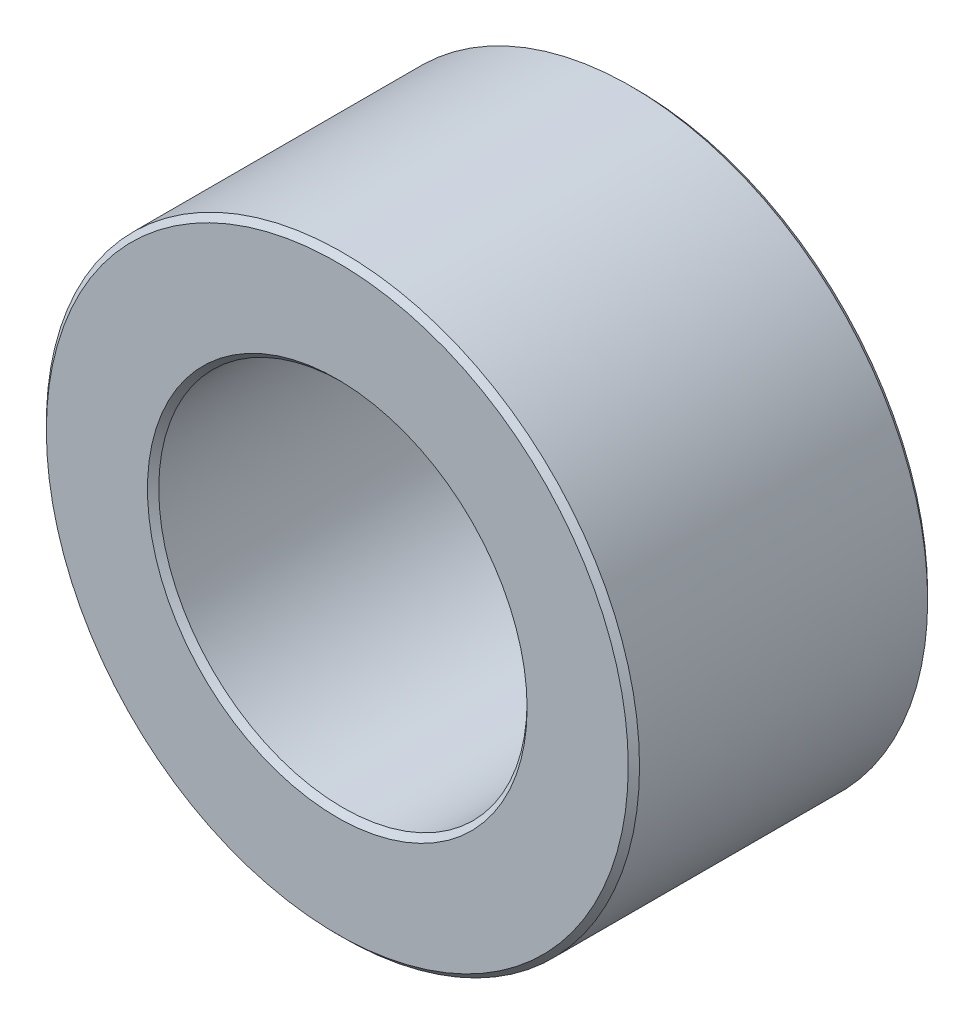
ISO-10303-21;
HEADER;
FILE_DESCRIPTION(('STEP AP214'),'2;1');
FILE_NAME('part.step','',(''),(''),'','','');
FILE_SCHEMA(('AUTOMOTIVE_DESIGN { 1 0 10303 214 1 1 1 1 }'));
ENDSEC;
DATA;
#1=APPLICATION_CONTEXT('core data for automotive mechanical design processes');
#2=APPLICATION_PROTOCOL_DEFINITION('international standard','automotive_design',2000,#1);
#3=PRODUCT_CONTEXT('',#1,'mechanical');
#4=PRODUCT('Part','Part','',(#3));
#5=PRODUCT_RELATED_PRODUCT_CATEGORY('part','',(#4));
#6=PRODUCT_DEFINITION_FORMATION('','',#4);
#7=PRODUCT_DEFINITION_CONTEXT('part definition',#1,'design');
#8=PRODUCT_DEFINITION('design','',#6,#7);
#9=PRODUCT_DEFINITION_SHAPE('','',#8);
#10=(LENGTH_UNIT() NAMED_UNIT(*) SI_UNIT(.MILLI.,.METRE.));
#11=(NAMED_UNIT(*) PLANE_ANGLE_UNIT() SI_UNIT($,.RADIAN.));
#12=(NAMED_UNIT(*) SI_UNIT($,.STERADIAN.) SOLID_ANGLE_UNIT());
#13=UNCERTAINTY_MEASURE_WITH_UNIT(LENGTH_MEASURE(1.E-05),#10,'distance_accuracy_value','');
#14=(GEOMETRIC_REPRESENTATION_CONTEXT(3) GLOBAL_UNCERTAINTY_ASSIGNED_CONTEXT((#13)) GLOBAL_UNIT_ASSIGNED_CONTEXT((#10,
#11,#12)) REPRESENTATION_CONTEXT('',''));
#15=CARTESIAN_POINT('',(0.,0.,0.));
#16=DIRECTION('',(0.,0.,1.));
#17=DIRECTION('',(1.,0.,0.));
#18=AXIS2_PLACEMENT_3D('',#15,#16,#17);
#19=CARTESIAN_POINT('',(0.,0.,53.));
#20=DIRECTION('',(0.,0.,1.));
#21=DIRECTION('',(1.,0.,0.));
#22=AXIS2_PLACEMENT_3D('',#19,#20,#21);
#23=PLANE('',#22);
#24=CARTESIAN_POINT('',(0.,0.,53.));
#25=DIRECTION('',(0.,0.,1.));
#26=DIRECTION('',(1.,0.,0.));
#27=AXIS2_PLACEMENT_3D('',#24,#25,#26);
#28=CIRCLE('',#27,33.6);
#29=CARTESIAN_POINT('',(33.6,0.,53.));
#30=VERTEX_POINT('',#29);
#31=EDGE_CURVE('E48',#30,#30,#28,.F.);
#32=ORIENTED_EDGE('',*,*,#31,.T.);
#33=EDGE_LOOP('',(#32));
#34=FACE_BOUND('',#33,.T.);
#35=CARTESIAN_POINT('',(0.,0.,53.));
#36=DIRECTION('',(0.,0.,1.));
#37=DIRECTION('',(1.,0.,0.));
#38=AXIS2_PLACEMENT_3D('',#35,#36,#37);
#39=CIRCLE('',#38,51.5);
#40=CARTESIAN_POINT('',(51.5,0.,53.));
#41=VERTEX_POINT('',#40);
#42=EDGE_CURVE('E52',#41,#41,#39,.T.);
#43=ORIENTED_EDGE('',*,*,#42,.T.);
#44=EDGE_LOOP('',(#43));
#45=FACE_BOUND('',#44,.T.);
#46=ADVANCED_FACE('F36',(#34,#45),#23,.T.);
#47=CARTESIAN_POINT('',(0.,0.,0.));
#48=DIRECTION('',(0.,0.,1.));
#49=DIRECTION('',(1.,0.,0.));
#50=AXIS2_PLACEMENT_3D('',#47,#48,#49);
#51=PLANE('',#50);
#52=CARTESIAN_POINT('',(0.,0.,0.));
#53=DIRECTION('',(0.,0.,1.));
#54=DIRECTION('',(1.,0.,0.));
#55=AXIS2_PLACEMENT_3D('',#52,#53,#54);
#56=CIRCLE('',#55,33.6);
#57=CARTESIAN_POINT('',(33.6,0.,0.));
#58=VERTEX_POINT('',#57);
#59=EDGE_CURVE('E63',#58,#58,#56,.T.);
#60=ORIENTED_EDGE('',*,*,#59,.T.);
#61=EDGE_LOOP('',(#60));
#62=FACE_BOUND('',#61,.T.);
#63=CARTESIAN_POINT('',(0.,0.,0.));
#64=DIRECTION('',(0.,0.,1.));
#65=DIRECTION('',(1.,0.,0.));
#66=AXIS2_PLACEMENT_3D('',#63,#64,#65);
#67=CIRCLE('',#66,51.5);
#68=CARTESIAN_POINT('',(51.5,0.,0.));
#69=VERTEX_POINT('',#68);
#70=EDGE_CURVE('E66',#69,#69,#67,.F.);
#71=ORIENTED_EDGE('',*,*,#70,.T.);
#72=EDGE_LOOP('',(#71));
#73=FACE_BOUND('',#72,.T.);
#74=ADVANCED_FACE('F70',(#62,#73),#51,.F.);
#75=CARTESIAN_POINT('',(0.,0.,53.));
#76=DIRECTION('',(0.,0.,-1.));
#77=DIRECTION('',(-1.,0.,0.));
#78=AXIS2_PLACEMENT_3D('',#75,#76,#77);
#79=CYLINDRICAL_SURFACE('',#78,52.5);
#80=CARTESIAN_POINT('',(0.,0.,0.999999999999966));
#81=DIRECTION('',(0.,0.,1.));
#82=DIRECTION('',(1.,0.,0.));
#83=AXIS2_PLACEMENT_3D('',#80,#81,#82);
#84=CIRCLE('',#83,52.5);
#85=CARTESIAN_POINT('',(52.5,0.,0.999999999999966));
#86=VERTEX_POINT('',#85);
#87=EDGE_CURVE('E10',#86,#86,#84,.T.);
#88=ORIENTED_EDGE('',*,*,#87,.T.);
#89=EDGE_LOOP('',(#88));
#90=FACE_BOUND('',#89,.T.);
#91=CARTESIAN_POINT('',(0.,0.,52.));
#92=DIRECTION('',(0.,0.,1.));
#93=DIRECTION('',(1.,0.,0.));
#94=AXIS2_PLACEMENT_3D('',#91,#92,#93);
#95=CIRCLE('',#94,52.5);
#96=CARTESIAN_POINT('',(52.5,0.,52.));
#97=VERTEX_POINT('',#96);
#98=EDGE_CURVE('E44',#97,#97,#95,.F.);
#99=ORIENTED_EDGE('',*,*,#98,.T.);
#100=EDGE_LOOP('',(#99));
#101=FACE_BOUND('',#100,.T.);
#102=ADVANCED_FACE('F91',(#90,#101),#79,.T.);
#103=CARTESIAN_POINT('',(0.,0.,53.));
#104=DIRECTION('',(0.,0.,-1.));
#105=DIRECTION('',(-1.,0.,0.));
#106=AXIS2_PLACEMENT_3D('',#103,#104,#105);
#107=CYLINDRICAL_SURFACE('',#106,32.6);
#108=CARTESIAN_POINT('',(0.,0.,1.00000000000001));
#109=DIRECTION('',(0.,0.,1.));
#110=DIRECTION('',(1.,0.,0.));
#111=AXIS2_PLACEMENT_3D('',#108,#109,#110);
#112=CIRCLE('',#111,32.6);
#113=CARTESIAN_POINT('',(32.6,0.,1.00000000000001));
#114=VERTEX_POINT('',#113);
#115=EDGE_CURVE('E57',#114,#114,#112,.F.);
#116=ORIENTED_EDGE('',*,*,#115,.T.);
#117=EDGE_LOOP('',(#116));
#118=FACE_BOUND('',#117,.T.);
#119=CARTESIAN_POINT('',(0.,0.,52.));
#120=DIRECTION('',(0.,0.,1.));
#121=DIRECTION('',(1.,0.,0.));
#122=AXIS2_PLACEMENT_3D('',#119,#120,#121);
#123=CIRCLE('',#122,32.6);
#124=CARTESIAN_POINT('',(32.6,0.,52.));
#125=VERTEX_POINT('',#124);
#126=EDGE_CURVE('E60',#125,#125,#123,.T.);
#127=ORIENTED_EDGE('',*,*,#126,.T.);
#128=EDGE_LOOP('',(#127));
#129=FACE_BOUND('',#128,.T.);
#130=ADVANCED_FACE('F96',(#118,#129),#107,.F.);
#131=CARTESIAN_POINT('',(0.,0.,0.));
#132=DIRECTION('',(0.,0.,-1.));
#133=DIRECTION('',(-1.,0.,0.));
#134=AXIS2_PLACEMENT_3D('',#131,#132,#133);
#135=CONICAL_SURFACE('',#134,33.6,0.785398163397445);
#136=ORIENTED_EDGE('',*,*,#115,.F.);
#137=EDGE_LOOP('',(#136));
#138=FACE_BOUND('',#137,.T.);
#139=ORIENTED_EDGE('',*,*,#59,.F.);
#140=EDGE_LOOP('',(#139));
#141=FACE_BOUND('',#140,.T.);
#142=ADVANCED_FACE('F81',(#138,#141),#135,.F.);
#143=CARTESIAN_POINT('',(0.,0.,52.));
#144=DIRECTION('',(0.,0.,1.));
#145=DIRECTION('',(1.,0.,0.));
#146=AXIS2_PLACEMENT_3D('',#143,#144,#145);
#147=CONICAL_SURFACE('',#146,32.6,0.785398163397448);
#148=ORIENTED_EDGE('',*,*,#31,.F.);
#149=EDGE_LOOP('',(#148));
#150=FACE_BOUND('',#149,.T.);
#151=ORIENTED_EDGE('',*,*,#126,.F.);
#152=EDGE_LOOP('',(#151));
#153=FACE_BOUND('',#152,.T.);
#154=ADVANCED_FACE('F75',(#150,#153),#147,.F.);
#155=CARTESIAN_POINT('',(0.,0.,0.999999999999966));
#156=DIRECTION('',(0.,0.,1.));
#157=DIRECTION('',(1.,0.,0.));
#158=AXIS2_PLACEMENT_3D('',#155,#156,#157);
#159=CONICAL_SURFACE('',#158,52.5,0.785398163397452);
#160=ORIENTED_EDGE('',*,*,#70,.F.);
#161=EDGE_LOOP('',(#160));
#162=FACE_BOUND('',#161,.T.);
#163=ORIENTED_EDGE('',*,*,#87,.F.);
#164=EDGE_LOOP('',(#163));
#165=FACE_BOUND('',#164,.T.);
#166=ADVANCED_FACE('F72',(#162,#165),#159,.T.);
#167=CARTESIAN_POINT('',(0.,0.,53.));
#168=DIRECTION('',(0.,0.,-1.));
#169=DIRECTION('',(-1.,0.,0.));
#170=AXIS2_PLACEMENT_3D('',#167,#168,#169);
#171=CONICAL_SURFACE('',#170,51.5,0.785398163397452);
#172=ORIENTED_EDGE('',*,*,#98,.F.);
#173=EDGE_LOOP('',(#172));
#174=FACE_BOUND('',#173,.T.);
#175=ORIENTED_EDGE('',*,*,#42,.F.);
#176=EDGE_LOOP('',(#175));
#177=FACE_BOUND('',#176,.T.);
#178=ADVANCED_FACE('F39',(#174,#177),#171,.T.);
#179=CLOSED_SHELL('',(#46,#74,#102,#130,#142,#154,#166,#178));
#180=MANIFOLD_SOLID_BREP('B2',#179);
#181=ADVANCED_BREP_SHAPE_REPRESENTATION('',(#18,#180),#14);
#182=SHAPE_DEFINITION_REPRESENTATION(#9,#181);
ENDSEC;
END-ISO-10303-21;
